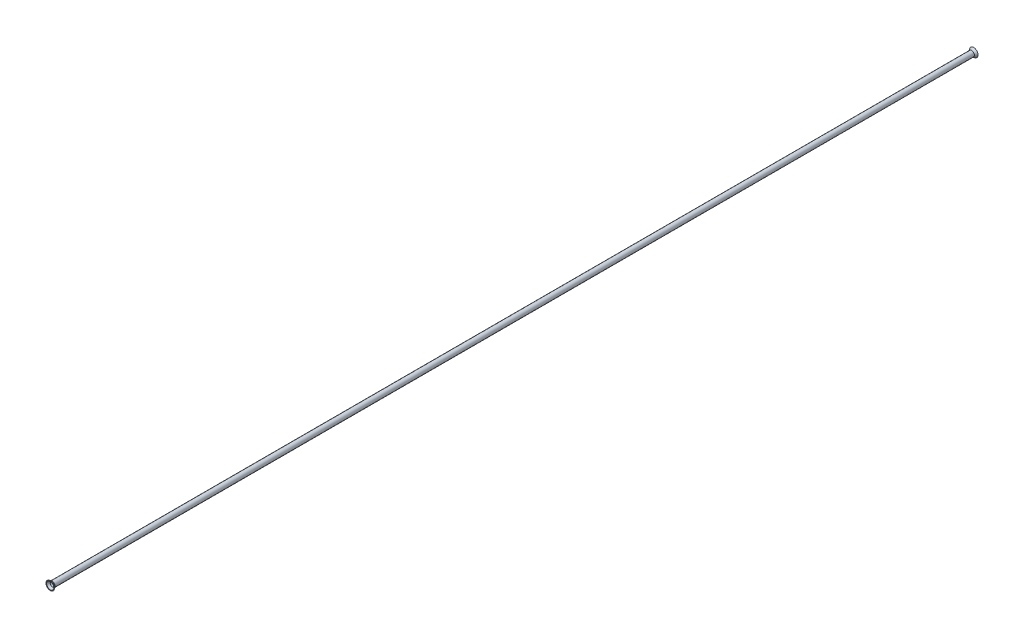
ISO-10303-21;
HEADER;
FILE_DESCRIPTION(('STEP AP214'),'2;1');
FILE_NAME('part.step','',(''),(''),'','','');
FILE_SCHEMA(('AUTOMOTIVE_DESIGN { 1 0 10303 214 1 1 1 1 }'));
ENDSEC;
DATA;
#1=APPLICATION_CONTEXT('core data for automotive mechanical design processes');
#2=APPLICATION_PROTOCOL_DEFINITION('international standard','automotive_design',2000,#1);
#3=PRODUCT_CONTEXT('',#1,'mechanical');
#4=PRODUCT('Part','Part','',(#3));
#5=PRODUCT_RELATED_PRODUCT_CATEGORY('part','',(#4));
#6=PRODUCT_DEFINITION_FORMATION('','',#4);
#7=PRODUCT_DEFINITION_CONTEXT('part definition',#1,'design');
#8=PRODUCT_DEFINITION('design','',#6,#7);
#9=PRODUCT_DEFINITION_SHAPE('','',#8);
#10=(LENGTH_UNIT() NAMED_UNIT(*) SI_UNIT(.MILLI.,.METRE.));
#11=(NAMED_UNIT(*) PLANE_ANGLE_UNIT() SI_UNIT($,.RADIAN.));
#12=(NAMED_UNIT(*) SI_UNIT($,.STERADIAN.) SOLID_ANGLE_UNIT());
#13=UNCERTAINTY_MEASURE_WITH_UNIT(LENGTH_MEASURE(1.E-05),#10,'distance_accuracy_value','');
#14=(GEOMETRIC_REPRESENTATION_CONTEXT(3) GLOBAL_UNCERTAINTY_ASSIGNED_CONTEXT((#13)) GLOBAL_UNIT_ASSIGNED_CONTEXT((#10,
#11,#12)) REPRESENTATION_CONTEXT('',''));
#15=CARTESIAN_POINT('',(0.,0.,0.));
#16=DIRECTION('',(0.,0.,1.));
#17=DIRECTION('',(1.,0.,0.));
#18=AXIS2_PLACEMENT_3D('',#15,#16,#17);
#19=CARTESIAN_POINT('',(0.,0.,-400.87677));
#20=DIRECTION('',(0.,0.,-1.));
#21=DIRECTION('',(1.,0.,0.));
#22=AXIS2_PLACEMENT_3D('',#19,#20,#21);
#23=PLANE('',#22);
#24=CARTESIAN_POINT('',(0.,0.,-400.87677));
#25=DIRECTION('',(0.,0.,-1.));
#26=DIRECTION('',(-1.,0.,0.));
#27=AXIS2_PLACEMENT_3D('',#24,#25,#26);
#28=CIRCLE('',#27,3.72106910108277);
#29=CARTESIAN_POINT('',(-3.72106910108277,0.,-400.87677));
#30=VERTEX_POINT('',#29);
#31=EDGE_CURVE('E52',#30,#30,#28,.F.);
#32=ORIENTED_EDGE('',*,*,#31,.F.);
#33=EDGE_LOOP('',(#32));
#34=FACE_BOUND('',#33,.T.);
#35=CARTESIAN_POINT('',(0.,0.,-400.87677));
#36=DIRECTION('',(0.,0.,1.));
#37=DIRECTION('',(1.,0.,0.));
#38=AXIS2_PLACEMENT_3D('',#35,#36,#37);
#39=CIRCLE('',#38,3.16226910108277);
#40=CARTESIAN_POINT('',(3.16226910108277,0.,-400.87677));
#41=VERTEX_POINT('',#40);
#42=EDGE_CURVE('E58',#41,#41,#39,.F.);
#43=ORIENTED_EDGE('',*,*,#42,.F.);
#44=EDGE_LOOP('',(#43));
#45=FACE_BOUND('',#44,.T.);
#46=ADVANCED_FACE('F32',(#34,#45),#23,.T.);
#47=CARTESIAN_POINT('',(0.,0.,399.09877));
#48=DIRECTION('',(0.,0.,-1.));
#49=DIRECTION('',(-1.,0.,0.));
#50=AXIS2_PLACEMENT_3D('',#47,#48,#49);
#51=CYLINDRICAL_SURFACE('',#50,2.38125);
#52=CARTESIAN_POINT('',(0.,0.,399.09877));
#53=DIRECTION('',(0.,0.,1.));
#54=DIRECTION('',(1.,0.,0.));
#55=AXIS2_PLACEMENT_3D('',#52,#53,#54);
#56=CIRCLE('',#55,2.38125);
#57=CARTESIAN_POINT('',(2.38125,0.,399.09877));
#58=VERTEX_POINT('',#57);
#59=EDGE_CURVE('E10',#58,#58,#56,.T.);
#60=ORIENTED_EDGE('',*,*,#59,.F.);
#61=EDGE_LOOP('',(#60));
#62=FACE_BOUND('',#61,.T.);
#63=CARTESIAN_POINT('',(0.,0.,-399.09877));
#64=DIRECTION('',(0.,0.,1.));
#65=DIRECTION('',(1.,0.,0.));
#66=AXIS2_PLACEMENT_3D('',#63,#64,#65);
#67=CIRCLE('',#66,2.38125);
#68=CARTESIAN_POINT('',(2.38125,0.,-399.09877));
#69=VERTEX_POINT('',#68);
#70=EDGE_CURVE('E55',#69,#69,#67,.T.);
#71=ORIENTED_EDGE('',*,*,#70,.T.);
#72=EDGE_LOOP('',(#71));
#73=FACE_BOUND('',#72,.T.);
#74=ADVANCED_FACE('F34',(#62,#73),#51,.T.);
#75=CARTESIAN_POINT('',(0.,0.,399.09877));
#76=DIRECTION('',(0.,0.,-1.));
#77=DIRECTION('',(-1.,0.,0.));
#78=AXIS2_PLACEMENT_3D('',#75,#76,#77);
#79=CYLINDRICAL_SURFACE('',#78,1.82245);
#80=CARTESIAN_POINT('',(0.,0.,399.09877));
#81=DIRECTION('',(0.,0.,-1.));
#82=DIRECTION('',(-1.,0.,0.));
#83=AXIS2_PLACEMENT_3D('',#80,#81,#82);
#84=CIRCLE('',#83,1.82245);
#85=CARTESIAN_POINT('',(-1.82245,0.,399.09877));
#86=VERTEX_POINT('',#85);
#87=EDGE_CURVE('E47',#86,#86,#84,.T.);
#88=ORIENTED_EDGE('',*,*,#87,.F.);
#89=EDGE_LOOP('',(#88));
#90=FACE_BOUND('',#89,.T.);
#91=CARTESIAN_POINT('',(0.,0.,-399.09877));
#92=DIRECTION('',(0.,0.,-1.));
#93=DIRECTION('',(-1.,0.,0.));
#94=AXIS2_PLACEMENT_3D('',#91,#92,#93);
#95=CIRCLE('',#94,1.82245);
#96=CARTESIAN_POINT('',(-1.82245,0.,-399.09877));
#97=VERTEX_POINT('',#96);
#98=EDGE_CURVE('E61',#97,#97,#95,.T.);
#99=ORIENTED_EDGE('',*,*,#98,.T.);
#100=EDGE_LOOP('',(#99));
#101=FACE_BOUND('',#100,.T.);
#102=ADVANCED_FACE('F65',(#90,#101),#79,.F.);
#103=CARTESIAN_POINT('',(0.,0.,399.09877));
#104=DIRECTION('',(0.,0.,1.));
#105=DIRECTION('',(1.,0.,0.));
#106=AXIS2_PLACEMENT_3D('',#103,#104,#105);
#107=CONICAL_SURFACE('',#106,2.38125,0.645771823237903);
#108=CARTESIAN_POINT('',(0.,0.,400.87677));
#109=DIRECTION('',(0.,0.,1.));
#110=DIRECTION('',(1.,0.,0.));
#111=AXIS2_PLACEMENT_3D('',#108,#109,#110);
#112=CIRCLE('',#111,3.72106910108277);
#113=CARTESIAN_POINT('',(3.72106910108277,0.,400.87677));
#114=VERTEX_POINT('',#113);
#115=EDGE_CURVE('E39',#114,#114,#112,.T.);
#116=ORIENTED_EDGE('',*,*,#115,.F.);
#117=EDGE_LOOP('',(#116));
#118=FACE_BOUND('',#117,.T.);
#119=ORIENTED_EDGE('',*,*,#59,.T.);
#120=EDGE_LOOP('',(#119));
#121=FACE_BOUND('',#120,.T.);
#122=ADVANCED_FACE('F94',(#118,#121),#107,.T.);
#123=CARTESIAN_POINT('',(0.,0.,400.87677));
#124=DIRECTION('',(0.,0.,1.));
#125=DIRECTION('',(1.,0.,0.));
#126=AXIS2_PLACEMENT_3D('',#123,#124,#125);
#127=PLANE('',#126);
#128=CARTESIAN_POINT('',(0.,0.,400.87677));
#129=DIRECTION('',(0.,0.,-1.));
#130=DIRECTION('',(-1.,0.,0.));
#131=AXIS2_PLACEMENT_3D('',#128,#129,#130);
#132=CIRCLE('',#131,3.16226910108277);
#133=CARTESIAN_POINT('',(-3.16226910108277,0.,400.87677));
#134=VERTEX_POINT('',#133);
#135=EDGE_CURVE('E43',#134,#134,#132,.T.);
#136=ORIENTED_EDGE('',*,*,#135,.T.);
#137=EDGE_LOOP('',(#136));
#138=FACE_BOUND('',#137,.T.);
#139=ORIENTED_EDGE('',*,*,#115,.T.);
#140=EDGE_LOOP('',(#139));
#141=FACE_BOUND('',#140,.T.);
#142=ADVANCED_FACE('F90',(#138,#141),#127,.T.);
#143=CARTESIAN_POINT('',(0.,0.,399.09877));
#144=DIRECTION('',(0.,0.,1.));
#145=DIRECTION('',(-1.,0.,0.));
#146=AXIS2_PLACEMENT_3D('',#143,#144,#145);
#147=CONICAL_SURFACE('',#146,1.82245,0.645771823237903);
#148=ORIENTED_EDGE('',*,*,#135,.F.);
#149=EDGE_LOOP('',(#148));
#150=FACE_BOUND('',#149,.T.);
#151=ORIENTED_EDGE('',*,*,#87,.T.);
#152=EDGE_LOOP('',(#151));
#153=FACE_BOUND('',#152,.T.);
#154=ADVANCED_FACE('F75',(#150,#153),#147,.F.);
#155=CARTESIAN_POINT('',(0.,0.,-399.09877));
#156=DIRECTION('',(0.,0.,-1.));
#157=DIRECTION('',(1.,0.,0.));
#158=AXIS2_PLACEMENT_3D('',#155,#156,#157);
#159=CONICAL_SURFACE('',#158,2.38125,0.645771823237903);
#160=ORIENTED_EDGE('',*,*,#31,.T.);
#161=EDGE_LOOP('',(#160));
#162=FACE_BOUND('',#161,.T.);
#163=ORIENTED_EDGE('',*,*,#70,.F.);
#164=EDGE_LOOP('',(#163));
#165=FACE_BOUND('',#164,.T.);
#166=ADVANCED_FACE('F69',(#162,#165),#159,.T.);
#167=CARTESIAN_POINT('',(0.,0.,-399.09877));
#168=DIRECTION('',(0.,0.,-1.));
#169=DIRECTION('',(-1.,0.,0.));
#170=AXIS2_PLACEMENT_3D('',#167,#168,#169);
#171=CONICAL_SURFACE('',#170,1.82245,0.645771823237903);
#172=ORIENTED_EDGE('',*,*,#42,.T.);
#173=EDGE_LOOP('',(#172));
#174=FACE_BOUND('',#173,.T.);
#175=ORIENTED_EDGE('',*,*,#98,.F.);
#176=EDGE_LOOP('',(#175));
#177=FACE_BOUND('',#176,.T.);
#178=ADVANCED_FACE('F67',(#174,#177),#171,.F.);
#179=CLOSED_SHELL('',(#46,#74,#102,#122,#142,#154,#166,#178));
#180=MANIFOLD_SOLID_BREP('B2',#179);
#181=ADVANCED_BREP_SHAPE_REPRESENTATION('',(#18,#180),#14);
#182=SHAPE_DEFINITION_REPRESENTATION(#9,#181);
ENDSEC;
END-ISO-10303-21;
